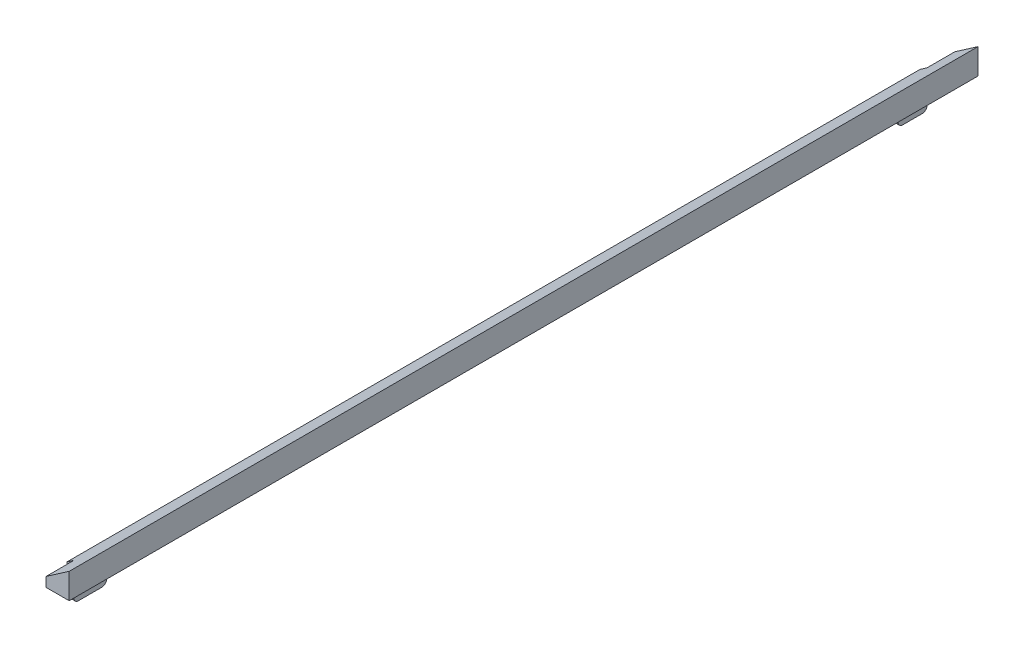
ISO-10303-21;
HEADER;
FILE_DESCRIPTION(('STEP AP214'),'2;1');
FILE_NAME('part.step','',(''),(''),'','','');
FILE_SCHEMA(('AUTOMOTIVE_DESIGN { 1 0 10303 214 1 1 1 1 }'));
ENDSEC;
DATA;
#1=APPLICATION_CONTEXT('core data for automotive mechanical design processes');
#2=APPLICATION_PROTOCOL_DEFINITION('international standard','automotive_design',2000,#1);
#3=PRODUCT_CONTEXT('',#1,'mechanical');
#4=PRODUCT('Part','Part','',(#3));
#5=PRODUCT_RELATED_PRODUCT_CATEGORY('part','',(#4));
#6=PRODUCT_DEFINITION_FORMATION('','',#4);
#7=PRODUCT_DEFINITION_CONTEXT('part definition',#1,'design');
#8=PRODUCT_DEFINITION('design','',#6,#7);
#9=PRODUCT_DEFINITION_SHAPE('','',#8);
#10=(LENGTH_UNIT() NAMED_UNIT(*) SI_UNIT(.MILLI.,.METRE.));
#11=(NAMED_UNIT(*) PLANE_ANGLE_UNIT() SI_UNIT($,.RADIAN.));
#12=(NAMED_UNIT(*) SI_UNIT($,.STERADIAN.) SOLID_ANGLE_UNIT());
#13=UNCERTAINTY_MEASURE_WITH_UNIT(LENGTH_MEASURE(1.E-05),#10,'distance_accuracy_value','');
#14=(GEOMETRIC_REPRESENTATION_CONTEXT(3) GLOBAL_UNCERTAINTY_ASSIGNED_CONTEXT((#13)) GLOBAL_UNIT_ASSIGNED_CONTEXT((#10,
#11,#12)) REPRESENTATION_CONTEXT('',''));
#15=CARTESIAN_POINT('',(0.,0.,0.));
#16=DIRECTION('',(0.,0.,1.));
#17=DIRECTION('',(1.,0.,0.));
#18=AXIS2_PLACEMENT_3D('',#15,#16,#17);
#19=CARTESIAN_POINT('',(-248.5,-8.00000000000053,184.));
#20=DIRECTION('',(0.,0.,1.));
#21=DIRECTION('',(0.,-1.,0.));
#22=AXIS2_PLACEMENT_3D('',#19,#20,#21);
#23=PLANE('',#22);
#24=DIRECTION('',(0.,1.,0.));
#25=VECTOR('',#24,1.);
#26=CARTESIAN_POINT('',(1.5,-15.2200869030885,184.));
#27=LINE('',#26,#25);
#28=CARTESIAN_POINT('',(1.5,-5.00000000000054,184.));
#29=VERTEX_POINT('',#28);
#30=CARTESIAN_POINT('',(1.49999999999997,0.,184.));
#31=VERTEX_POINT('',#30);
#32=EDGE_CURVE('E228',#29,#31,#27,.T.);
#33=ORIENTED_EDGE('',*,*,#32,.T.);
#34=DIRECTION('',(0.,-1.,0.));
#35=VECTOR('',#34,1.);
#36=CARTESIAN_POINT('',(1.49999999999997,0.,184.));
#37=LINE('',#36,#35);
#38=CARTESIAN_POINT('',(1.49999999999997,2.03846153846154,184.));
#39=VERTEX_POINT('',#38);
#40=EDGE_CURVE('E187',#39,#31,#37,.T.);
#41=ORIENTED_EDGE('',*,*,#40,.F.);
#42=DIRECTION('',(-0.822192191643779,-0.569209978830308,0.));
#43=VECTOR('',#42,1.);
#44=CARTESIAN_POINT('',(0.,1.,184.));
#45=LINE('',#44,#43);
#46=CARTESIAN_POINT('',(0.,1.00000000000005,184.));
#47=VERTEX_POINT('',#46);
#48=EDGE_CURVE('E252',#39,#47,#45,.T.);
#49=ORIENTED_EDGE('',*,*,#48,.T.);
#50=DIRECTION('',(0.,-1.,0.));
#51=VECTOR('',#50,1.);
#52=CARTESIAN_POINT('',(0.,0.,184.));
#53=LINE('',#52,#51);
#54=CARTESIAN_POINT('',(0.,-5.00000000000054,184.));
#55=VERTEX_POINT('',#54);
#56=EDGE_CURVE('E261',#47,#55,#53,.T.);
#57=ORIENTED_EDGE('',*,*,#56,.T.);
#58=DIRECTION('',(1.,0.,0.));
#59=VECTOR('',#58,1.);
#60=CARTESIAN_POINT('',(1.5,-5.00000000000054,184.));
#61=LINE('',#60,#59);
#62=EDGE_CURVE('E290',#55,#29,#61,.T.);
#63=ORIENTED_EDGE('',*,*,#62,.T.);
#64=EDGE_LOOP('',(#33,#41,#49,#57,#63));
#65=FACE_BOUND('',#64,.T.);
#66=ADVANCED_FACE('F34',(#65),#23,.T.);
#67=CARTESIAN_POINT('',(0.,0.,0.));
#68=DIRECTION('',(0.,0.,-1.));
#69=DIRECTION('',(-1.,0.,0.));
#70=AXIS2_PLACEMENT_3D('',#67,#68,#69);
#71=PLANE('',#70);
#72=DIRECTION('',(-0.822192191643779,-0.569209978830308,0.));
#73=VECTOR('',#72,1.);
#74=CARTESIAN_POINT('',(0.,1.,0.));
#75=LINE('',#74,#73);
#76=CARTESIAN_POINT('',(1.49999999999998,2.03846153846153,0.));
#77=VERTEX_POINT('',#76);
#78=CARTESIAN_POINT('',(0.,1.,0.));
#79=VERTEX_POINT('',#78);
#80=EDGE_CURVE('E240',#77,#79,#75,.T.);
#81=ORIENTED_EDGE('',*,*,#80,.F.);
#82=DIRECTION('',(0.,1.,0.));
#83=VECTOR('',#82,1.);
#84=CARTESIAN_POINT('',(1.49999999999998,2.03846153846153,0.));
#85=LINE('',#84,#83);
#86=CARTESIAN_POINT('',(1.49999999999998,0.,0.));
#87=VERTEX_POINT('',#86);
#88=EDGE_CURVE('E49',#87,#77,#85,.T.);
#89=ORIENTED_EDGE('',*,*,#88,.F.);
#90=DIRECTION('',(0.,1.,0.));
#91=VECTOR('',#90,1.);
#92=CARTESIAN_POINT('',(1.49999999999997,-15.2200869030885,0.));
#93=LINE('',#92,#91);
#94=CARTESIAN_POINT('',(1.49999999999997,-5.00000000000057,0.));
#95=VERTEX_POINT('',#94);
#96=EDGE_CURVE('E237',#95,#87,#93,.T.);
#97=ORIENTED_EDGE('',*,*,#96,.F.);
#98=DIRECTION('',(-1.,0.,0.));
#99=VECTOR('',#98,1.);
#100=CARTESIAN_POINT('',(0.,-5.00000000000057,0.));
#101=LINE('',#100,#99);
#102=CARTESIAN_POINT('',(0.,-5.00000000000057,0.));
#103=VERTEX_POINT('',#102);
#104=EDGE_CURVE('E293',#95,#103,#101,.T.);
#105=ORIENTED_EDGE('',*,*,#104,.T.);
#106=DIRECTION('',(0.,-1.,0.));
#107=VECTOR('',#106,1.);
#108=CARTESIAN_POINT('',(0.,0.,0.));
#109=LINE('',#108,#107);
#110=EDGE_CURVE('E258',#79,#103,#109,.T.);
#111=ORIENTED_EDGE('',*,*,#110,.F.);
#112=EDGE_LOOP('',(#81,#89,#97,#105,#111));
#113=FACE_BOUND('',#112,.T.);
#114=ADVANCED_FACE('F311',(#113),#71,.T.);
#115=CARTESIAN_POINT('',(0.,0.,195.514693182963));
#116=DIRECTION('',(0.,1.,0.));
#117=DIRECTION('',(0.,0.,1.));
#118=AXIS2_PLACEMENT_3D('',#115,#116,#117);
#119=PLANE('',#118);
#120=DIRECTION('',(0.,0.,1.));
#121=VECTOR('',#120,1.);
#122=CARTESIAN_POINT('',(1.5,0.,184.));
#123=LINE('',#122,#121);
#124=CARTESIAN_POINT('',(1.5,0.,176.937446999268));
#125=VERTEX_POINT('',#124);
#126=EDGE_CURVE('E225',#125,#31,#123,.T.);
#127=ORIENTED_EDGE('',*,*,#126,.F.);
#128=DIRECTION('',(1.,0.,0.));
#129=VECTOR('',#128,1.);
#130=CARTESIAN_POINT('',(0.,0.,176.937446999268));
#131=LINE('',#130,#129);
#132=CARTESIAN_POINT('',(0.,0.,176.937446999268));
#133=VERTEX_POINT('',#132);
#134=EDGE_CURVE('E222',#133,#125,#131,.T.);
#135=ORIENTED_EDGE('',*,*,#134,.F.);
#136=DIRECTION('',(0.,0.,-1.));
#137=VECTOR('',#136,1.);
#138=CARTESIAN_POINT('',(0.,0.,195.514693182963));
#139=LINE('',#138,#137);
#140=CARTESIAN_POINT('',(0.,0.,6.24371840671145));
#141=VERTEX_POINT('',#140);
#142=EDGE_CURVE('E168',#133,#141,#139,.T.);
#143=ORIENTED_EDGE('',*,*,#142,.T.);
#144=DIRECTION('',(-1.,0.,0.));
#145=VECTOR('',#144,1.);
#146=CARTESIAN_POINT('',(0.,0.,6.24371840671145));
#147=LINE('',#146,#145);
#148=CARTESIAN_POINT('',(1.49999999999997,0.,6.24371840671145));
#149=VERTEX_POINT('',#148);
#150=EDGE_CURVE('E243',#149,#141,#147,.T.);
#151=ORIENTED_EDGE('',*,*,#150,.F.);
#152=DIRECTION('',(0.,0.,1.));
#153=VECTOR('',#152,1.);
#154=CARTESIAN_POINT('',(1.49999999999997,0.,0.));
#155=LINE('',#154,#153);
#156=EDGE_CURVE('E221',#87,#149,#155,.T.);
#157=ORIENTED_EDGE('',*,*,#156,.F.);
#158=DIRECTION('',(0.,0.,1.));
#159=VECTOR('',#158,1.);
#160=CARTESIAN_POINT('',(1.49999999999998,0.,-13.4330343736595));
#161=LINE('',#160,#159);
#162=CARTESIAN_POINT('',(1.49999999999998,0.,-6.0000000000002));
#163=VERTEX_POINT('',#162);
#164=EDGE_CURVE('E182',#163,#87,#161,.T.);
#165=ORIENTED_EDGE('',*,*,#164,.F.);
#166=DIRECTION('',(-1.,0.,0.));
#167=VECTOR('',#166,1.);
#168=CARTESIAN_POINT('',(1.49999999999998,0.,-6.0000000000002));
#169=LINE('',#168,#167);
#170=CARTESIAN_POINT('',(6.50000000000001,0.,-6.0000000000002));
#171=VERTEX_POINT('',#170);
#172=EDGE_CURVE('E163',#171,#163,#169,.T.);
#173=ORIENTED_EDGE('',*,*,#172,.F.);
#174=DIRECTION('',(0.,0.,-1.));
#175=VECTOR('',#174,1.);
#176=CARTESIAN_POINT('',(6.50000000000001,0.,195.514693182963));
#177=LINE('',#176,#175);
#178=CARTESIAN_POINT('',(6.50000000000001,0.,190.));
#179=VERTEX_POINT('',#178);
#180=EDGE_CURVE('E153',#179,#171,#177,.T.);
#181=ORIENTED_EDGE('',*,*,#180,.F.);
#182=DIRECTION('',(1.,0.,0.));
#183=VECTOR('',#182,1.);
#184=CARTESIAN_POINT('',(6.50000000000001,0.,190.));
#185=LINE('',#184,#183);
#186=CARTESIAN_POINT('',(1.49999999999997,0.,190.));
#187=VERTEX_POINT('',#186);
#188=EDGE_CURVE('E159',#187,#179,#185,.T.);
#189=ORIENTED_EDGE('',*,*,#188,.F.);
#190=DIRECTION('',(0.,0.,-1.));
#191=VECTOR('',#190,1.);
#192=CARTESIAN_POINT('',(1.49999999999997,0.,197.433034373659));
#193=LINE('',#192,#191);
#194=EDGE_CURVE('E177',#187,#31,#193,.T.);
#195=ORIENTED_EDGE('',*,*,#194,.T.);
#196=EDGE_LOOP('',(#127,#135,#143,#151,#157,#165,#173,#181,#189,#195));
#197=FACE_BOUND('',#196,.T.);
#198=ADVANCED_FACE('F156',(#197),#119,.F.);
#199=CARTESIAN_POINT('',(0.,0.,195.514693182963));
#200=DIRECTION('',(1.,0.,0.));
#201=DIRECTION('',(0.,0.,-1.));
#202=AXIS2_PLACEMENT_3D('',#199,#200,#201);
#203=PLANE('',#202);
#204=CARTESIAN_POINT('',(0.,-3.00000000000027,3.06255300073155));
#205=DIRECTION('',(1.,0.,0.));
#206=DIRECTION('',(0.,0.,1.));
#207=AXIS2_PLACEMENT_3D('',#204,#205,#206);
#208=CIRCLE('',#207,1.4);
#209=CARTESIAN_POINT('',(0.,-3.00000000000027,4.46255300073155));
#210=VERTEX_POINT('',#209);
#211=EDGE_CURVE('E199',#210,#210,#208,.T.);
#212=ORIENTED_EDGE('',*,*,#211,.T.);
#213=EDGE_LOOP('',(#212));
#214=FACE_BOUND('',#213,.T.);
#215=CARTESIAN_POINT('',(0.,-3.00000000000027,180.937446999268));
#216=DIRECTION('',(-1.,0.,0.));
#217=DIRECTION('',(0.,0.,-1.));
#218=AXIS2_PLACEMENT_3D('',#215,#216,#217);
#219=CIRCLE('',#218,1.4);
#220=CARTESIAN_POINT('',(0.,-3.00000000000027,179.537446999268));
#221=VERTEX_POINT('',#220);
#222=EDGE_CURVE('E210',#221,#221,#219,.T.);
#223=ORIENTED_EDGE('',*,*,#222,.F.);
#224=EDGE_LOOP('',(#223));
#225=FACE_BOUND('',#224,.T.);
#226=DIRECTION('',(0.,1.,0.));
#227=VECTOR('',#226,1.);
#228=CARTESIAN_POINT('',(0.,-15.2200869030885,176.937446999268));
#229=LINE('',#228,#227);
#230=CARTESIAN_POINT('',(0.,-5.00000000000054,176.937446999268));
#231=VERTEX_POINT('',#230);
#232=EDGE_CURVE('E218',#231,#133,#229,.T.);
#233=ORIENTED_EDGE('',*,*,#232,.F.);
#234=CARTESIAN_POINT('',(0.,-5.00000000000054,177.937446999268));
#235=DIRECTION('',(1.,0.,0.));
#236=DIRECTION('',(0.,0.,-1.));
#237=AXIS2_PLACEMENT_3D('',#234,#235,#236);
#238=CIRCLE('',#237,1.);
#239=CARTESIAN_POINT('',(0.,-6.00000000000054,177.937446999268));
#240=VERTEX_POINT('',#239);
#241=EDGE_CURVE('E280',#231,#240,#238,.F.);
#242=ORIENTED_EDGE('',*,*,#241,.T.);
#243=DIRECTION('',(0.,0.,1.));
#244=VECTOR('',#243,1.);
#245=CARTESIAN_POINT('',(0.,-6.00000000000054,184.));
#246=LINE('',#245,#244);
#247=CARTESIAN_POINT('',(0.,-6.00000000000054,183.));
#248=VERTEX_POINT('',#247);
#249=EDGE_CURVE('E217',#240,#248,#246,.T.);
#250=ORIENTED_EDGE('',*,*,#249,.T.);
#251=CARTESIAN_POINT('',(0.,-5.00000000000054,183.));
#252=DIRECTION('',(1.,0.,0.));
#253=DIRECTION('',(0.,0.,-1.));
#254=AXIS2_PLACEMENT_3D('',#251,#252,#253);
#255=CIRCLE('',#254,1.);
#256=EDGE_CURVE('E278',#248,#55,#255,.F.);
#257=ORIENTED_EDGE('',*,*,#256,.T.);
#258=ORIENTED_EDGE('',*,*,#56,.F.);
#259=DIRECTION('',(0.,0.,-1.));
#260=VECTOR('',#259,1.);
#261=CARTESIAN_POINT('',(0.,1.,184.));
#262=LINE('',#261,#260);
#263=EDGE_CURVE('E254',#47,#79,#262,.T.);
#264=ORIENTED_EDGE('',*,*,#263,.T.);
#265=ORIENTED_EDGE('',*,*,#110,.T.);
#266=CARTESIAN_POINT('',(0.,-5.00000000000057,1.));
#267=DIRECTION('',(1.,0.,0.));
#268=DIRECTION('',(0.,0.,-1.));
#269=AXIS2_PLACEMENT_3D('',#266,#267,#268);
#270=CIRCLE('',#269,1.);
#271=CARTESIAN_POINT('',(0.,-6.00000000000057,1.));
#272=VERTEX_POINT('',#271);
#273=EDGE_CURVE('E276',#103,#272,#270,.F.);
#274=ORIENTED_EDGE('',*,*,#273,.T.);
#275=DIRECTION('',(0.,0.,1.));
#276=VECTOR('',#275,1.);
#277=CARTESIAN_POINT('',(0.,-6.00000000000057,0.));
#278=LINE('',#277,#276);
#279=CARTESIAN_POINT('',(0.,-6.00000000000056,5.24371840671145));
#280=VERTEX_POINT('',#279);
#281=EDGE_CURVE('E236',#272,#280,#278,.T.);
#282=ORIENTED_EDGE('',*,*,#281,.T.);
#283=CARTESIAN_POINT('',(0.,-5.00000000000056,5.24371840671145));
#284=DIRECTION('',(1.,0.,0.));
#285=DIRECTION('',(0.,0.,-1.));
#286=AXIS2_PLACEMENT_3D('',#283,#284,#285);
#287=CIRCLE('',#286,1.);
#288=CARTESIAN_POINT('',(0.,-5.00000000000056,6.24371840671145));
#289=VERTEX_POINT('',#288);
#290=EDGE_CURVE('E274',#280,#289,#287,.F.);
#291=ORIENTED_EDGE('',*,*,#290,.T.);
#292=DIRECTION('',(0.,1.,0.));
#293=VECTOR('',#292,1.);
#294=CARTESIAN_POINT('',(0.,-15.2200869030885,6.24371840671145));
#295=LINE('',#294,#293);
#296=EDGE_CURVE('E246',#289,#141,#295,.T.);
#297=ORIENTED_EDGE('',*,*,#296,.T.);
#298=ORIENTED_EDGE('',*,*,#142,.F.);
#299=EDGE_LOOP('',(#233,#242,#250,#257,#258,#264,#265,#274,#282,#291,#297,#298));
#300=FACE_BOUND('',#299,.T.);
#301=ADVANCED_FACE('F317',(#214,#225,#300),#203,.F.);
#302=CARTESIAN_POINT('',(6.50000000000001,0.,195.514693182963));
#303=DIRECTION('',(-1.,0.,0.));
#304=DIRECTION('',(0.,0.,1.));
#305=AXIS2_PLACEMENT_3D('',#302,#303,#304);
#306=PLANE('',#305);
#307=DIRECTION('',(0.,0.,-1.));
#308=VECTOR('',#307,1.);
#309=CARTESIAN_POINT('',(6.50000000000001,5.5,195.514693182963));
#310=LINE('',#309,#308);
#311=CARTESIAN_POINT('',(6.50000000000001,5.5,190.));
#312=VERTEX_POINT('',#311);
#313=CARTESIAN_POINT('',(6.50000000000001,5.5,-6.0000000000002));
#314=VERTEX_POINT('',#313);
#315=EDGE_CURVE('E167',#312,#314,#310,.T.);
#316=ORIENTED_EDGE('',*,*,#315,.F.);
#317=DIRECTION('',(0.,1.,0.));
#318=VECTOR('',#317,1.);
#319=CARTESIAN_POINT('',(6.50000000000001,5.5,190.));
#320=LINE('',#319,#318);
#321=EDGE_CURVE('E171',#179,#312,#320,.T.);
#322=ORIENTED_EDGE('',*,*,#321,.F.);
#323=ORIENTED_EDGE('',*,*,#180,.T.);
#324=DIRECTION('',(0.,-1.,0.));
#325=VECTOR('',#324,1.);
#326=CARTESIAN_POINT('',(6.50000000000001,0.,-6.0000000000002));
#327=LINE('',#326,#325);
#328=EDGE_CURVE('E204',#314,#171,#327,.T.);
#329=ORIENTED_EDGE('',*,*,#328,.F.);
#330=EDGE_LOOP('',(#316,#322,#323,#329));
#331=FACE_BOUND('',#330,.T.);
#332=ADVANCED_FACE('F172',(#331),#306,.F.);
#333=CARTESIAN_POINT('',(0.,1.,184.));
#334=DIRECTION('',(0.569209978830308,-0.822192191643779,0.));
#335=DIRECTION('',(0.822192191643779,0.569209978830308,0.));
#336=AXIS2_PLACEMENT_3D('',#333,#334,#335);
#337=PLANE('',#336);
#338=ORIENTED_EDGE('',*,*,#315,.T.);
#339=DIRECTION('',(0.822192191643779,0.569209978830308,0.));
#340=VECTOR('',#339,1.);
#341=CARTESIAN_POINT('',(6.50000000000001,5.5,-6.0000000000002));
#342=LINE('',#341,#340);
#343=CARTESIAN_POINT('',(1.49999999999998,2.03846153846153,-6.0000000000002));
#344=VERTEX_POINT('',#343);
#345=EDGE_CURVE('E196',#344,#314,#342,.T.);
#346=ORIENTED_EDGE('',*,*,#345,.F.);
#347=DIRECTION('',(0.,0.,1.));
#348=VECTOR('',#347,1.);
#349=CARTESIAN_POINT('',(1.49999999999998,2.03846153846153,-13.4330343736595));
#350=LINE('',#349,#348);
#351=EDGE_CURVE('E195',#344,#77,#350,.T.);
#352=ORIENTED_EDGE('',*,*,#351,.T.);
#353=ORIENTED_EDGE('',*,*,#80,.T.);
#354=ORIENTED_EDGE('',*,*,#263,.F.);
#355=ORIENTED_EDGE('',*,*,#48,.F.);
#356=DIRECTION('',(0.,0.,-1.));
#357=VECTOR('',#356,1.);
#358=CARTESIAN_POINT('',(1.49999999999997,2.03846153846154,197.433034373659));
#359=LINE('',#358,#357);
#360=CARTESIAN_POINT('',(1.49999999999997,2.03846153846154,190.));
#361=VERTEX_POINT('',#360);
#362=EDGE_CURVE('E190',#361,#39,#359,.T.);
#363=ORIENTED_EDGE('',*,*,#362,.F.);
#364=DIRECTION('',(-0.82219219164378,-0.569209978830306,0.));
#365=VECTOR('',#364,1.);
#366=CARTESIAN_POINT('',(1.49999999999997,2.03846153846154,190.));
#367=LINE('',#366,#365);
#368=EDGE_CURVE('E176',#312,#361,#367,.T.);
#369=ORIENTED_EDGE('',*,*,#368,.F.);
#370=EDGE_LOOP('',(#338,#346,#352,#353,#354,#355,#363,#369));
#371=FACE_BOUND('',#370,.T.);
#372=ADVANCED_FACE('F353',(#371),#337,.F.);
#373=CARTESIAN_POINT('',(0.,-15.2200869030885,6.24371840671145));
#374=DIRECTION('',(0.,0.,-1.));
#375=DIRECTION('',(-1.,0.,0.));
#376=AXIS2_PLACEMENT_3D('',#373,#374,#375);
#377=PLANE('',#376);
#378=ORIENTED_EDGE('',*,*,#296,.F.);
#379=DIRECTION('',(1.,0.,0.));
#380=VECTOR('',#379,1.);
#381=CARTESIAN_POINT('',(0.,-5.00000000000056,6.24371840671145));
#382=LINE('',#381,#380);
#383=CARTESIAN_POINT('',(1.49999999999997,-5.00000000000056,6.24371840671145));
#384=VERTEX_POINT('',#383);
#385=EDGE_CURVE('E12',#289,#384,#382,.T.);
#386=ORIENTED_EDGE('',*,*,#385,.T.);
#387=DIRECTION('',(0.,1.,0.));
#388=VECTOR('',#387,1.);
#389=CARTESIAN_POINT('',(1.49999999999997,-15.2200869030885,6.24371840671145));
#390=LINE('',#389,#388);
#391=EDGE_CURVE('E248',#384,#149,#390,.T.);
#392=ORIENTED_EDGE('',*,*,#391,.T.);
#393=ORIENTED_EDGE('',*,*,#150,.T.);
#394=EDGE_LOOP('',(#378,#386,#392,#393));
#395=FACE_BOUND('',#394,.T.);
#396=ADVANCED_FACE('F324',(#395),#377,.F.);
#397=CARTESIAN_POINT('',(1.49999999999997,-15.2200869030885,0.));
#398=DIRECTION('',(-1.,0.,0.));
#399=DIRECTION('',(0.,0.,1.));
#400=AXIS2_PLACEMENT_3D('',#397,#398,#399);
#401=PLANE('',#400);
#402=CARTESIAN_POINT('',(1.49999999999997,-3.00000000000027,3.06255300073155));
#403=DIRECTION('',(-1.,0.,0.));
#404=DIRECTION('',(0.,0.,1.));
#405=AXIS2_PLACEMENT_3D('',#402,#403,#404);
#406=CIRCLE('',#405,1.4);
#407=CARTESIAN_POINT('',(1.49999999999997,-3.00000000000027,4.46255300073155));
#408=VERTEX_POINT('',#407);
#409=EDGE_CURVE('E209',#408,#408,#406,.F.);
#410=ORIENTED_EDGE('',*,*,#409,.F.);
#411=EDGE_LOOP('',(#410));
#412=FACE_BOUND('',#411,.T.);
#413=DIRECTION('',(0.,0.,-1.));
#414=VECTOR('',#413,1.);
#415=CARTESIAN_POINT('',(1.49999999999997,-6.00000000000057,0.));
#416=LINE('',#415,#414);
#417=CARTESIAN_POINT('',(1.49999999999997,-6.00000000000056,5.24371840671145));
#418=VERTEX_POINT('',#417);
#419=CARTESIAN_POINT('',(1.49999999999997,-6.00000000000057,1.));
#420=VERTEX_POINT('',#419);
#421=EDGE_CURVE('E233',#418,#420,#416,.T.);
#422=ORIENTED_EDGE('',*,*,#421,.T.);
#423=CARTESIAN_POINT('',(1.49999999999997,-5.00000000000057,1.));
#424=DIRECTION('',(-1.,0.,0.));
#425=DIRECTION('',(0.,0.,1.));
#426=AXIS2_PLACEMENT_3D('',#423,#424,#425);
#427=CIRCLE('',#426,1.);
#428=EDGE_CURVE('E42',#420,#95,#427,.F.);
#429=ORIENTED_EDGE('',*,*,#428,.T.);
#430=ORIENTED_EDGE('',*,*,#96,.T.);
#431=ORIENTED_EDGE('',*,*,#156,.T.);
#432=ORIENTED_EDGE('',*,*,#391,.F.);
#433=CARTESIAN_POINT('',(1.49999999999997,-5.00000000000056,5.24371840671145));
#434=DIRECTION('',(-1.,0.,0.));
#435=DIRECTION('',(0.,0.,1.));
#436=AXIS2_PLACEMENT_3D('',#433,#434,#435);
#437=CIRCLE('',#436,1.);
#438=EDGE_CURVE('E57',#384,#418,#437,.F.);
#439=ORIENTED_EDGE('',*,*,#438,.T.);
#440=EDGE_LOOP('',(#422,#429,#430,#431,#432,#439));
#441=FACE_BOUND('',#440,.T.);
#442=ADVANCED_FACE('F303',(#412,#441),#401,.F.);
#443=CARTESIAN_POINT('',(-18.5,-6.00000000000056,12.9999999999999));
#444=DIRECTION('',(0.,1.,0.));
#445=DIRECTION('',(1.,0.,0.));
#446=AXIS2_PLACEMENT_3D('',#443,#444,#445);
#447=PLANE('',#446);
#448=ORIENTED_EDGE('',*,*,#281,.F.);
#449=DIRECTION('',(-1.,0.,0.));
#450=VECTOR('',#449,1.);
#451=CARTESIAN_POINT('',(1.49999999999997,-6.00000000000057,1.));
#452=LINE('',#451,#450);
#453=EDGE_CURVE('E298',#272,#420,#452,.F.);
#454=ORIENTED_EDGE('',*,*,#453,.T.);
#455=ORIENTED_EDGE('',*,*,#421,.F.);
#456=DIRECTION('',(1.,0.,0.));
#457=VECTOR('',#456,1.);
#458=CARTESIAN_POINT('',(-18.5,-6.00000000000056,5.24371840671145));
#459=LINE('',#458,#457);
#460=EDGE_CURVE('E296',#418,#280,#459,.F.);
#461=ORIENTED_EDGE('',*,*,#460,.T.);
#462=EDGE_LOOP('',(#448,#454,#455,#461));
#463=FACE_BOUND('',#462,.T.);
#464=ADVANCED_FACE('F320',(#463),#447,.F.);
#465=CARTESIAN_POINT('',(1.5,-15.2200869030885,184.));
#466=DIRECTION('',(-1.,0.,0.));
#467=DIRECTION('',(0.,0.,1.));
#468=AXIS2_PLACEMENT_3D('',#465,#466,#467);
#469=PLANE('',#468);
#470=CARTESIAN_POINT('',(1.5,-3.00000000000027,180.937446999268));
#471=DIRECTION('',(-1.,0.,0.));
#472=DIRECTION('',(0.,0.,1.));
#473=AXIS2_PLACEMENT_3D('',#470,#471,#472);
#474=CIRCLE('',#473,1.4);
#475=CARTESIAN_POINT('',(1.5,-3.00000000000027,182.337446999268));
#476=VERTEX_POINT('',#475);
#477=EDGE_CURVE('E213',#476,#476,#474,.T.);
#478=ORIENTED_EDGE('',*,*,#477,.T.);
#479=EDGE_LOOP('',(#478));
#480=FACE_BOUND('',#479,.T.);
#481=DIRECTION('',(0.,0.,-1.));
#482=VECTOR('',#481,1.);
#483=CARTESIAN_POINT('',(1.5,-6.00000000000054,184.));
#484=LINE('',#483,#482);
#485=CARTESIAN_POINT('',(1.5,-6.00000000000054,183.));
#486=VERTEX_POINT('',#485);
#487=CARTESIAN_POINT('',(1.5,-6.00000000000054,177.937446999268));
#488=VERTEX_POINT('',#487);
#489=EDGE_CURVE('E214',#486,#488,#484,.T.);
#490=ORIENTED_EDGE('',*,*,#489,.T.);
#491=CARTESIAN_POINT('',(1.5,-5.00000000000054,177.937446999268));
#492=DIRECTION('',(-1.,0.,0.));
#493=DIRECTION('',(0.,0.,1.));
#494=AXIS2_PLACEMENT_3D('',#491,#492,#493);
#495=CIRCLE('',#494,1.);
#496=CARTESIAN_POINT('',(1.5,-5.00000000000054,176.937446999268));
#497=VERTEX_POINT('',#496);
#498=EDGE_CURVE('E288',#488,#497,#495,.F.);
#499=ORIENTED_EDGE('',*,*,#498,.T.);
#500=DIRECTION('',(0.,1.,0.));
#501=VECTOR('',#500,1.);
#502=CARTESIAN_POINT('',(1.5,-15.2200869030885,176.937446999268));
#503=LINE('',#502,#501);
#504=EDGE_CURVE('E230',#497,#125,#503,.T.);
#505=ORIENTED_EDGE('',*,*,#504,.T.);
#506=ORIENTED_EDGE('',*,*,#126,.T.);
#507=ORIENTED_EDGE('',*,*,#32,.F.);
#508=CARTESIAN_POINT('',(1.5,-5.00000000000054,183.));
#509=DIRECTION('',(-1.,0.,0.));
#510=DIRECTION('',(0.,0.,1.));
#511=AXIS2_PLACEMENT_3D('',#508,#509,#510);
#512=CIRCLE('',#511,1.);
#513=EDGE_CURVE('E286',#29,#486,#512,.F.);
#514=ORIENTED_EDGE('',*,*,#513,.T.);
#515=EDGE_LOOP('',(#490,#499,#505,#506,#507,#514));
#516=FACE_BOUND('',#515,.T.);
#517=ADVANCED_FACE('F342',(#480,#516),#469,.F.);
#518=CARTESIAN_POINT('',(0.,-15.2200869030885,176.937446999268));
#519=DIRECTION('',(0.,0.,1.));
#520=DIRECTION('',(1.,0.,0.));
#521=AXIS2_PLACEMENT_3D('',#518,#519,#520);
#522=PLANE('',#521);
#523=ORIENTED_EDGE('',*,*,#504,.F.);
#524=DIRECTION('',(-1.,0.,0.));
#525=VECTOR('',#524,1.);
#526=CARTESIAN_POINT('',(0.,-5.00000000000054,176.937446999268));
#527=LINE('',#526,#525);
#528=EDGE_CURVE('E264',#497,#231,#527,.T.);
#529=ORIENTED_EDGE('',*,*,#528,.T.);
#530=ORIENTED_EDGE('',*,*,#232,.T.);
#531=ORIENTED_EDGE('',*,*,#134,.T.);
#532=EDGE_LOOP('',(#523,#529,#530,#531));
#533=FACE_BOUND('',#532,.T.);
#534=ADVANCED_FACE('F331',(#533),#522,.F.);
#535=CARTESIAN_POINT('',(-18.5,-6.00000000000056,12.9999999999999));
#536=DIRECTION('',(0.,1.,0.));
#537=DIRECTION('',(1.,0.,0.));
#538=AXIS2_PLACEMENT_3D('',#535,#536,#537);
#539=PLANE('',#538);
#540=ORIENTED_EDGE('',*,*,#249,.F.);
#541=DIRECTION('',(-1.,0.,0.));
#542=VECTOR('',#541,1.);
#543=CARTESIAN_POINT('',(-18.5,-6.00000000000054,177.937446999268));
#544=LINE('',#543,#542);
#545=EDGE_CURVE('E284',#240,#488,#544,.F.);
#546=ORIENTED_EDGE('',*,*,#545,.T.);
#547=ORIENTED_EDGE('',*,*,#489,.F.);
#548=DIRECTION('',(1.,0.,0.));
#549=VECTOR('',#548,1.);
#550=CARTESIAN_POINT('',(0.,-6.00000000000054,183.));
#551=LINE('',#550,#549);
#552=EDGE_CURVE('E282',#486,#248,#551,.F.);
#553=ORIENTED_EDGE('',*,*,#552,.T.);
#554=EDGE_LOOP('',(#540,#546,#547,#553));
#555=FACE_BOUND('',#554,.T.);
#556=ADVANCED_FACE('F339',(#555),#539,.F.);
#557=CARTESIAN_POINT('',(6.50000000000001,-3.00000000000027,180.937446999268));
#558=DIRECTION('',(-1.,0.,0.));
#559=DIRECTION('',(0.,0.,1.));
#560=AXIS2_PLACEMENT_3D('',#557,#558,#559);
#561=CYLINDRICAL_SURFACE('',#560,1.4);
#562=ORIENTED_EDGE('',*,*,#222,.T.);
#563=EDGE_LOOP('',(#562));
#564=FACE_BOUND('',#563,.T.);
#565=ORIENTED_EDGE('',*,*,#477,.F.);
#566=EDGE_LOOP('',(#565));
#567=FACE_BOUND('',#566,.T.);
#568=ADVANCED_FACE('F474',(#564,#567),#561,.F.);
#569=CARTESIAN_POINT('',(6.50000000000001,-3.00000000000027,3.06255300073155));
#570=DIRECTION('',(-1.,0.,0.));
#571=DIRECTION('',(0.,0.,1.));
#572=AXIS2_PLACEMENT_3D('',#569,#570,#571);
#573=CYLINDRICAL_SURFACE('',#572,1.4);
#574=ORIENTED_EDGE('',*,*,#211,.F.);
#575=EDGE_LOOP('',(#574));
#576=FACE_BOUND('',#575,.T.);
#577=ORIENTED_EDGE('',*,*,#409,.T.);
#578=EDGE_LOOP('',(#577));
#579=FACE_BOUND('',#578,.T.);
#580=ADVANCED_FACE('F379',(#576,#579),#573,.F.);
#581=CARTESIAN_POINT('',(0.,-5.00000000000054,177.937446999268));
#582=DIRECTION('',(-1.,0.,0.));
#583=DIRECTION('',(0.,-1.,0.));
#584=AXIS2_PLACEMENT_3D('',#581,#582,#583);
#585=CYLINDRICAL_SURFACE('',#584,1.);
#586=ORIENTED_EDGE('',*,*,#498,.F.);
#587=ORIENTED_EDGE('',*,*,#545,.F.);
#588=ORIENTED_EDGE('',*,*,#241,.F.);
#589=ORIENTED_EDGE('',*,*,#528,.F.);
#590=EDGE_LOOP('',(#586,#587,#588,#589));
#591=FACE_BOUND('',#590,.T.);
#592=ADVANCED_FACE('F335',(#591),#585,.T.);
#593=CARTESIAN_POINT('',(-248.5,-5.00000000000051,183.));
#594=DIRECTION('',(-1.,0.,0.));
#595=DIRECTION('',(0.,-1.,0.));
#596=AXIS2_PLACEMENT_3D('',#593,#594,#595);
#597=CYLINDRICAL_SURFACE('',#596,1.);
#598=ORIENTED_EDGE('',*,*,#256,.F.);
#599=ORIENTED_EDGE('',*,*,#552,.F.);
#600=ORIENTED_EDGE('',*,*,#513,.F.);
#601=ORIENTED_EDGE('',*,*,#62,.F.);
#602=EDGE_LOOP('',(#598,#599,#600,#601));
#603=FACE_BOUND('',#602,.T.);
#604=ADVANCED_FACE('F347',(#603),#597,.T.);
#605=CARTESIAN_POINT('',(0.,-5.00000000000057,1.));
#606=DIRECTION('',(1.,0.,0.));
#607=DIRECTION('',(0.,1.,0.));
#608=AXIS2_PLACEMENT_3D('',#605,#606,#607);
#609=CYLINDRICAL_SURFACE('',#608,1.);
#610=ORIENTED_EDGE('',*,*,#428,.F.);
#611=ORIENTED_EDGE('',*,*,#453,.F.);
#612=ORIENTED_EDGE('',*,*,#273,.F.);
#613=ORIENTED_EDGE('',*,*,#104,.F.);
#614=EDGE_LOOP('',(#610,#611,#612,#613));
#615=FACE_BOUND('',#614,.T.);
#616=ADVANCED_FACE('F313',(#615),#609,.T.);
#617=CARTESIAN_POINT('',(0.,-5.00000000000056,5.24371840671145));
#618=DIRECTION('',(1.,0.,0.));
#619=DIRECTION('',(0.,1.,0.));
#620=AXIS2_PLACEMENT_3D('',#617,#618,#619);
#621=CYLINDRICAL_SURFACE('',#620,1.);
#622=ORIENTED_EDGE('',*,*,#290,.F.);
#623=ORIENTED_EDGE('',*,*,#460,.F.);
#624=ORIENTED_EDGE('',*,*,#438,.F.);
#625=ORIENTED_EDGE('',*,*,#385,.F.);
#626=EDGE_LOOP('',(#622,#623,#624,#625));
#627=FACE_BOUND('',#626,.T.);
#628=ADVANCED_FACE('F36',(#627),#621,.T.);
#629=CARTESIAN_POINT('',(1.49999999999998,2.03846153846153,-13.4330343736595));
#630=DIRECTION('',(1.,0.,0.));
#631=DIRECTION('',(0.,1.,0.));
#632=AXIS2_PLACEMENT_3D('',#629,#630,#631);
#633=PLANE('',#632);
#634=DIRECTION('',(0.,1.,0.));
#635=VECTOR('',#634,1.);
#636=CARTESIAN_POINT('',(1.49999999999998,2.03846153846153,-6.0000000000002));
#637=LINE('',#636,#635);
#638=EDGE_CURVE('E200',#163,#344,#637,.T.);
#639=ORIENTED_EDGE('',*,*,#638,.F.);
#640=ORIENTED_EDGE('',*,*,#164,.T.);
#641=ORIENTED_EDGE('',*,*,#88,.T.);
#642=ORIENTED_EDGE('',*,*,#351,.F.);
#643=EDGE_LOOP('',(#639,#640,#641,#642));
#644=FACE_BOUND('',#643,.T.);
#645=ADVANCED_FACE('F354',(#644),#633,.F.);
#646=CARTESIAN_POINT('',(3.5,10.9999999999995,-6.0000000000002));
#647=DIRECTION('',(0.,0.,-1.));
#648=DIRECTION('',(0.,-1.,0.));
#649=AXIS2_PLACEMENT_3D('',#646,#647,#648);
#650=PLANE('',#649);
#651=ORIENTED_EDGE('',*,*,#328,.T.);
#652=ORIENTED_EDGE('',*,*,#172,.T.);
#653=ORIENTED_EDGE('',*,*,#638,.T.);
#654=ORIENTED_EDGE('',*,*,#345,.T.);
#655=EDGE_LOOP('',(#651,#652,#653,#654));
#656=FACE_BOUND('',#655,.T.);
#657=ADVANCED_FACE('F356',(#656),#650,.T.);
#658=CARTESIAN_POINT('',(1.49999999999997,0.,197.433034373659));
#659=DIRECTION('',(1.,0.,0.));
#660=DIRECTION('',(0.,1.,0.));
#661=AXIS2_PLACEMENT_3D('',#658,#659,#660);
#662=PLANE('',#661);
#663=DIRECTION('',(0.,-1.,0.));
#664=VECTOR('',#663,1.);
#665=CARTESIAN_POINT('',(1.49999999999997,0.,190.));
#666=LINE('',#665,#664);
#667=EDGE_CURVE('E181',#361,#187,#666,.T.);
#668=ORIENTED_EDGE('',*,*,#667,.F.);
#669=ORIENTED_EDGE('',*,*,#362,.T.);
#670=ORIENTED_EDGE('',*,*,#40,.T.);
#671=ORIENTED_EDGE('',*,*,#194,.F.);
#672=EDGE_LOOP('',(#668,#669,#670,#671));
#673=FACE_BOUND('',#672,.T.);
#674=ADVANCED_FACE('F358',(#673),#662,.F.);
#675=CARTESIAN_POINT('',(3.50000000000003,235.999999999999,190.));
#676=DIRECTION('',(0.,0.,1.));
#677=DIRECTION('',(0.,1.,0.));
#678=AXIS2_PLACEMENT_3D('',#675,#676,#677);
#679=PLANE('',#678);
#680=ORIENTED_EDGE('',*,*,#321,.T.);
#681=ORIENTED_EDGE('',*,*,#368,.T.);
#682=ORIENTED_EDGE('',*,*,#667,.T.);
#683=ORIENTED_EDGE('',*,*,#188,.T.);
#684=EDGE_LOOP('',(#680,#681,#682,#683));
#685=FACE_BOUND('',#684,.T.);
#686=ADVANCED_FACE('F180',(#685),#679,.T.);
#687=CLOSED_SHELL('',(#66,#114,#198,#301,#332,#372,#396,#442,#464,#517,#534,#556,#568,#580,#592,
#604,#616,#628,#645,#657,#674,#686));
#688=MANIFOLD_SOLID_BREP('B2',#687);
#689=ADVANCED_BREP_SHAPE_REPRESENTATION('',(#18,#688),#14);
#690=SHAPE_DEFINITION_REPRESENTATION(#9,#689);
ENDSEC;
END-ISO-10303-21;
